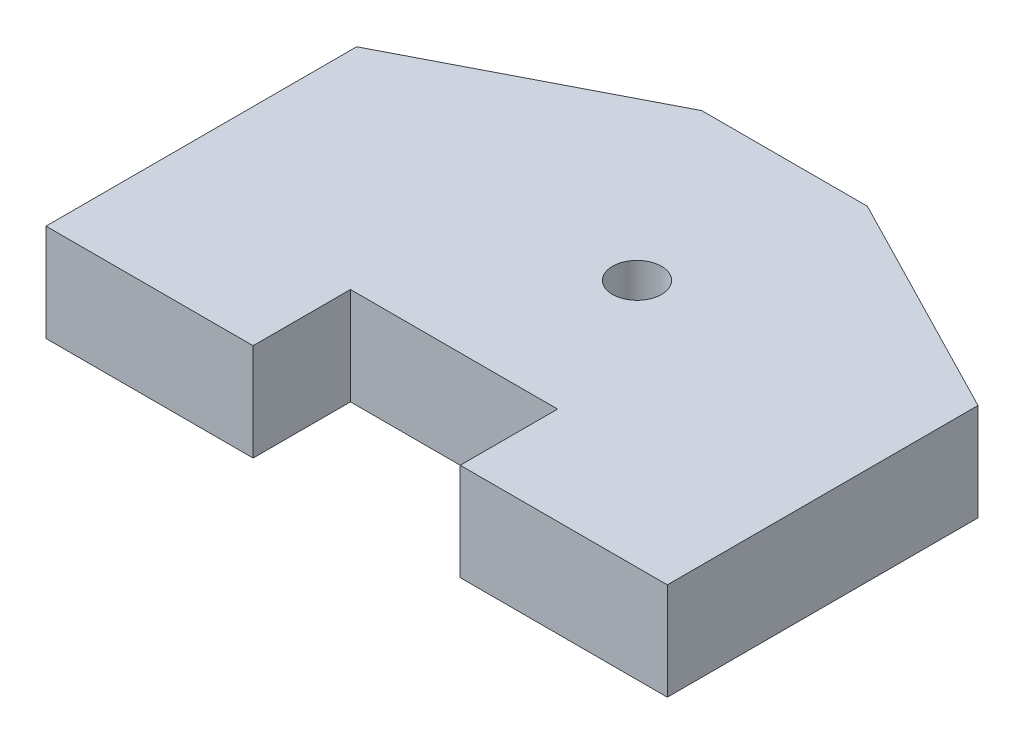
ISO-10303-21;
HEADER;
FILE_DESCRIPTION(('STEP AP214'),'2;1');
FILE_NAME('part.step','',(''),(''),'','','');
FILE_SCHEMA(('AUTOMOTIVE_DESIGN { 1 0 10303 214 1 1 1 1 }'));
ENDSEC;
DATA;
#1=APPLICATION_CONTEXT('core data for automotive mechanical design processes');
#2=APPLICATION_PROTOCOL_DEFINITION('international standard','automotive_design',2000,#1);
#3=PRODUCT_CONTEXT('',#1,'mechanical');
#4=PRODUCT('Part','Part','',(#3));
#5=PRODUCT_RELATED_PRODUCT_CATEGORY('part','',(#4));
#6=PRODUCT_DEFINITION_FORMATION('','',#4);
#7=PRODUCT_DEFINITION_CONTEXT('part definition',#1,'design');
#8=PRODUCT_DEFINITION('design','',#6,#7);
#9=PRODUCT_DEFINITION_SHAPE('','',#8);
#10=(LENGTH_UNIT() NAMED_UNIT(*) SI_UNIT(.MILLI.,.METRE.));
#11=(NAMED_UNIT(*) PLANE_ANGLE_UNIT() SI_UNIT($,.RADIAN.));
#12=(NAMED_UNIT(*) SI_UNIT($,.STERADIAN.) SOLID_ANGLE_UNIT());
#13=UNCERTAINTY_MEASURE_WITH_UNIT(LENGTH_MEASURE(1.E-05),#10,'distance_accuracy_value','');
#14=(GEOMETRIC_REPRESENTATION_CONTEXT(3) GLOBAL_UNCERTAINTY_ASSIGNED_CONTEXT((#13)) GLOBAL_UNIT_ASSIGNED_CONTEXT((#10,
#11,#12)) REPRESENTATION_CONTEXT('',''));
#15=CARTESIAN_POINT('',(0.,0.,0.));
#16=DIRECTION('',(0.,0.,1.));
#17=DIRECTION('',(1.,0.,0.));
#18=AXIS2_PLACEMENT_3D('',#15,#16,#17);
#19=CARTESIAN_POINT('',(0.,5.969,0.));
#20=DIRECTION('',(0.,-1.,0.));
#21=DIRECTION('',(0.,0.,-1.));
#22=AXIS2_PLACEMENT_3D('',#19,#20,#21);
#23=PLANE('',#22);
#24=DIRECTION('',(0.,0.,1.));
#25=VECTOR('',#24,1.);
#26=CARTESIAN_POINT('',(0.,5.969,0.));
#27=LINE('',#26,#25);
#28=CARTESIAN_POINT('',(0.,5.969,-19.05));
#29=VERTEX_POINT('',#28);
#30=CARTESIAN_POINT('',(0.,5.969,0.));
#31=VERTEX_POINT('',#30);
#32=EDGE_CURVE('E160',#29,#31,#27,.T.);
#33=ORIENTED_EDGE('',*,*,#32,.T.);
#34=DIRECTION('',(1.,0.,0.));
#35=VECTOR('',#34,1.);
#36=CARTESIAN_POINT('',(0.,5.969,0.));
#37=LINE('',#36,#35);
#38=CARTESIAN_POINT('',(12.7,5.969,0.));
#39=VERTEX_POINT('',#38);
#40=EDGE_CURVE('E98',#31,#39,#37,.T.);
#41=ORIENTED_EDGE('',*,*,#40,.T.);
#42=DIRECTION('',(0.,0.,-1.));
#43=VECTOR('',#42,1.);
#44=CARTESIAN_POINT('',(12.7,5.969,0.));
#45=LINE('',#44,#43);
#46=CARTESIAN_POINT('',(12.7,5.969,-5.969));
#47=VERTEX_POINT('',#46);
#48=EDGE_CURVE('E181',#39,#47,#45,.T.);
#49=ORIENTED_EDGE('',*,*,#48,.T.);
#50=DIRECTION('',(1.,0.,0.));
#51=VECTOR('',#50,1.);
#52=CARTESIAN_POINT('',(12.7,5.969,-5.969));
#53=LINE('',#52,#51);
#54=CARTESIAN_POINT('',(25.4,5.969,-5.969));
#55=VERTEX_POINT('',#54);
#56=EDGE_CURVE('E200',#47,#55,#53,.T.);
#57=ORIENTED_EDGE('',*,*,#56,.T.);
#58=DIRECTION('',(0.,0.,1.));
#59=VECTOR('',#58,1.);
#60=CARTESIAN_POINT('',(25.4,5.969,-5.969));
#61=LINE('',#60,#59);
#62=CARTESIAN_POINT('',(25.4,5.969,0.));
#63=VERTEX_POINT('',#62);
#64=EDGE_CURVE('E197',#55,#63,#61,.T.);
#65=ORIENTED_EDGE('',*,*,#64,.T.);
#66=DIRECTION('',(1.,0.,0.));
#67=VECTOR('',#66,1.);
#68=CARTESIAN_POINT('',(25.4,5.969,0.));
#69=LINE('',#68,#67);
#70=CARTESIAN_POINT('',(38.1,5.969,0.));
#71=VERTEX_POINT('',#70);
#72=EDGE_CURVE('E199',#63,#71,#69,.T.);
#73=ORIENTED_EDGE('',*,*,#72,.T.);
#74=DIRECTION('',(0.,0.,-1.));
#75=VECTOR('',#74,1.);
#76=CARTESIAN_POINT('',(38.1,5.969,0.));
#77=LINE('',#76,#75);
#78=CARTESIAN_POINT('',(38.1,5.969,-19.05));
#79=VERTEX_POINT('',#78);
#80=EDGE_CURVE('E123',#71,#79,#77,.T.);
#81=ORIENTED_EDGE('',*,*,#80,.T.);
#82=DIRECTION('',(-0.889180512855365,0.,-0.457556570883066));
#83=VECTOR('',#82,1.);
#84=CARTESIAN_POINT('',(38.1,5.969,-19.05));
#85=LINE('',#84,#83);
#86=CARTESIAN_POINT('',(24.13,5.969,-26.2387150053593));
#87=VERTEX_POINT('',#86);
#88=EDGE_CURVE('E117',#79,#87,#85,.T.);
#89=ORIENTED_EDGE('',*,*,#88,.T.);
#90=DIRECTION('',(-1.,0.,0.));
#91=VECTOR('',#90,1.);
#92=CARTESIAN_POINT('',(13.97,5.969,-26.2387150053593));
#93=LINE('',#92,#91);
#94=CARTESIAN_POINT('',(13.97,5.969,-26.2387150053593));
#95=VERTEX_POINT('',#94);
#96=EDGE_CURVE('E121',#87,#95,#93,.T.);
#97=ORIENTED_EDGE('',*,*,#96,.T.);
#98=DIRECTION('',(-0.889180512855365,0.,0.457556570883066));
#99=VECTOR('',#98,1.);
#100=CARTESIAN_POINT('',(0.,5.969,-19.05));
#101=LINE('',#100,#99);
#102=EDGE_CURVE('E49',#95,#29,#101,.T.);
#103=ORIENTED_EDGE('',*,*,#102,.T.);
#104=EDGE_LOOP('',(#33,#41,#49,#57,#65,#73,#81,#89,#97,#103));
#105=FACE_BOUND('',#104,.T.);
#106=CARTESIAN_POINT('',(21.,5.969,-15.24));
#107=DIRECTION('',(0.,1.,0.));
#108=DIRECTION('',(0.,0.,1.));
#109=AXIS2_PLACEMENT_3D('',#106,#107,#108);
#110=CIRCLE('',#109,1.5);
#111=CARTESIAN_POINT('',(21.,5.969,-13.74));
#112=VERTEX_POINT('',#111);
#113=EDGE_CURVE('E145',#112,#112,#110,.T.);
#114=ORIENTED_EDGE('',*,*,#113,.F.);
#115=EDGE_LOOP('',(#114));
#116=FACE_BOUND('',#115,.T.);
#117=ADVANCED_FACE('F32',(#105,#116),#23,.F.);
#118=CARTESIAN_POINT('',(0.,0.,0.));
#119=DIRECTION('',(0.,-1.,0.));
#120=DIRECTION('',(0.,0.,-1.));
#121=AXIS2_PLACEMENT_3D('',#118,#119,#120);
#122=PLANE('',#121);
#123=DIRECTION('',(0.,0.,1.));
#124=VECTOR('',#123,1.);
#125=CARTESIAN_POINT('',(0.,0.,0.));
#126=LINE('',#125,#124);
#127=CARTESIAN_POINT('',(0.,0.,-19.05));
#128=VERTEX_POINT('',#127);
#129=CARTESIAN_POINT('',(0.,0.,0.));
#130=VERTEX_POINT('',#129);
#131=EDGE_CURVE('E141',#128,#130,#126,.T.);
#132=ORIENTED_EDGE('',*,*,#131,.F.);
#133=DIRECTION('',(-0.889180512855365,0.,0.457556570883066));
#134=VECTOR('',#133,1.);
#135=CARTESIAN_POINT('',(0.,0.,-19.05));
#136=LINE('',#135,#134);
#137=CARTESIAN_POINT('',(13.97,0.,-26.2387150053593));
#138=VERTEX_POINT('',#137);
#139=EDGE_CURVE('E90',#138,#128,#136,.T.);
#140=ORIENTED_EDGE('',*,*,#139,.F.);
#141=DIRECTION('',(-1.,0.,0.));
#142=VECTOR('',#141,1.);
#143=CARTESIAN_POINT('',(13.97,0.,-26.2387150053593));
#144=LINE('',#143,#142);
#145=CARTESIAN_POINT('',(24.13,0.,-26.2387150053593));
#146=VERTEX_POINT('',#145);
#147=EDGE_CURVE('E84',#146,#138,#144,.T.);
#148=ORIENTED_EDGE('',*,*,#147,.F.);
#149=DIRECTION('',(-0.889180512855365,0.,-0.457556570883066));
#150=VECTOR('',#149,1.);
#151=CARTESIAN_POINT('',(38.1,0.,-19.05));
#152=LINE('',#151,#150);
#153=CARTESIAN_POINT('',(38.1,0.,-19.05));
#154=VERTEX_POINT('',#153);
#155=EDGE_CURVE('E131',#154,#146,#152,.T.);
#156=ORIENTED_EDGE('',*,*,#155,.F.);
#157=DIRECTION('',(0.,0.,-1.));
#158=VECTOR('',#157,1.);
#159=CARTESIAN_POINT('',(38.1,0.,0.));
#160=LINE('',#159,#158);
#161=CARTESIAN_POINT('',(38.1,0.,0.));
#162=VERTEX_POINT('',#161);
#163=EDGE_CURVE('E155',#162,#154,#160,.T.);
#164=ORIENTED_EDGE('',*,*,#163,.F.);
#165=DIRECTION('',(1.,0.,0.));
#166=VECTOR('',#165,1.);
#167=CARTESIAN_POINT('',(25.4,0.,0.));
#168=LINE('',#167,#166);
#169=CARTESIAN_POINT('',(25.4,0.,0.));
#170=VERTEX_POINT('',#169);
#171=EDGE_CURVE('E153',#170,#162,#168,.T.);
#172=ORIENTED_EDGE('',*,*,#171,.F.);
#173=DIRECTION('',(0.,0.,1.));
#174=VECTOR('',#173,1.);
#175=CARTESIAN_POINT('',(25.4,0.,-5.969));
#176=LINE('',#175,#174);
#177=CARTESIAN_POINT('',(25.4,0.,-5.969));
#178=VERTEX_POINT('',#177);
#179=EDGE_CURVE('E151',#178,#170,#176,.T.);
#180=ORIENTED_EDGE('',*,*,#179,.F.);
#181=DIRECTION('',(1.,0.,0.));
#182=VECTOR('',#181,1.);
#183=CARTESIAN_POINT('',(12.7,0.,-5.969));
#184=LINE('',#183,#182);
#185=CARTESIAN_POINT('',(12.7,0.,-5.969));
#186=VERTEX_POINT('',#185);
#187=EDGE_CURVE('E149',#186,#178,#184,.T.);
#188=ORIENTED_EDGE('',*,*,#187,.F.);
#189=DIRECTION('',(0.,0.,-1.));
#190=VECTOR('',#189,1.);
#191=CARTESIAN_POINT('',(12.7,0.,0.));
#192=LINE('',#191,#190);
#193=CARTESIAN_POINT('',(12.7,0.,0.));
#194=VERTEX_POINT('',#193);
#195=EDGE_CURVE('E147',#194,#186,#192,.T.);
#196=ORIENTED_EDGE('',*,*,#195,.F.);
#197=DIRECTION('',(1.,0.,0.));
#198=VECTOR('',#197,1.);
#199=CARTESIAN_POINT('',(0.,0.,0.));
#200=LINE('',#199,#198);
#201=EDGE_CURVE('E144',#130,#194,#200,.T.);
#202=ORIENTED_EDGE('',*,*,#201,.F.);
#203=EDGE_LOOP('',(#132,#140,#148,#156,#164,#172,#180,#188,#196,#202));
#204=FACE_BOUND('',#203,.T.);
#205=CARTESIAN_POINT('',(21.,0.,-15.24));
#206=DIRECTION('',(0.,1.,0.));
#207=DIRECTION('',(0.,0.,1.));
#208=AXIS2_PLACEMENT_3D('',#205,#206,#207);
#209=CIRCLE('',#208,1.5);
#210=CARTESIAN_POINT('',(21.,0.,-13.74));
#211=VERTEX_POINT('',#210);
#212=EDGE_CURVE('E208',#211,#211,#209,.T.);
#213=ORIENTED_EDGE('',*,*,#212,.T.);
#214=EDGE_LOOP('',(#213));
#215=FACE_BOUND('',#214,.T.);
#216=ADVANCED_FACE('F185',(#204,#215),#122,.T.);
#217=CARTESIAN_POINT('',(0.,5.969,0.));
#218=DIRECTION('',(1.,0.,0.));
#219=DIRECTION('',(0.,0.,-1.));
#220=AXIS2_PLACEMENT_3D('',#217,#218,#219);
#221=PLANE('',#220);
#222=ORIENTED_EDGE('',*,*,#131,.T.);
#223=DIRECTION('',(0.,-1.,0.));
#224=VECTOR('',#223,1.);
#225=CARTESIAN_POINT('',(0.,5.969,0.));
#226=LINE('',#225,#224);
#227=EDGE_CURVE('E11',#31,#130,#226,.T.);
#228=ORIENTED_EDGE('',*,*,#227,.F.);
#229=ORIENTED_EDGE('',*,*,#32,.F.);
#230=DIRECTION('',(0.,-1.,0.));
#231=VECTOR('',#230,1.);
#232=CARTESIAN_POINT('',(0.,5.969,-19.05));
#233=LINE('',#232,#231);
#234=EDGE_CURVE('E137',#29,#128,#233,.T.);
#235=ORIENTED_EDGE('',*,*,#234,.T.);
#236=EDGE_LOOP('',(#222,#228,#229,#235));
#237=FACE_BOUND('',#236,.T.);
#238=ADVANCED_FACE('F34',(#237),#221,.F.);
#239=CARTESIAN_POINT('',(0.,5.969,0.));
#240=DIRECTION('',(0.,0.,-1.));
#241=DIRECTION('',(-1.,0.,0.));
#242=AXIS2_PLACEMENT_3D('',#239,#240,#241);
#243=PLANE('',#242);
#244=ORIENTED_EDGE('',*,*,#201,.T.);
#245=DIRECTION('',(0.,-1.,0.));
#246=VECTOR('',#245,1.);
#247=CARTESIAN_POINT('',(12.7,5.969,0.));
#248=LINE('',#247,#246);
#249=EDGE_CURVE('E41',#39,#194,#248,.T.);
#250=ORIENTED_EDGE('',*,*,#249,.F.);
#251=ORIENTED_EDGE('',*,*,#40,.F.);
#252=ORIENTED_EDGE('',*,*,#227,.T.);
#253=EDGE_LOOP('',(#244,#250,#251,#252));
#254=FACE_BOUND('',#253,.T.);
#255=ADVANCED_FACE('F244',(#254),#243,.F.);
#256=CARTESIAN_POINT('',(12.7,5.969,0.));
#257=DIRECTION('',(-1.,0.,0.));
#258=DIRECTION('',(0.,0.,1.));
#259=AXIS2_PLACEMENT_3D('',#256,#257,#258);
#260=PLANE('',#259);
#261=ORIENTED_EDGE('',*,*,#195,.T.);
#262=DIRECTION('',(0.,-1.,0.));
#263=VECTOR('',#262,1.);
#264=CARTESIAN_POINT('',(12.7,5.969,-5.969));
#265=LINE('',#264,#263);
#266=EDGE_CURVE('E173',#47,#186,#265,.T.);
#267=ORIENTED_EDGE('',*,*,#266,.F.);
#268=ORIENTED_EDGE('',*,*,#48,.F.);
#269=ORIENTED_EDGE('',*,*,#249,.T.);
#270=EDGE_LOOP('',(#261,#267,#268,#269));
#271=FACE_BOUND('',#270,.T.);
#272=ADVANCED_FACE('F179',(#271),#260,.F.);
#273=CARTESIAN_POINT('',(12.7,5.969,-5.969));
#274=DIRECTION('',(0.,0.,-1.));
#275=DIRECTION('',(-1.,0.,0.));
#276=AXIS2_PLACEMENT_3D('',#273,#274,#275);
#277=PLANE('',#276);
#278=ORIENTED_EDGE('',*,*,#187,.T.);
#279=DIRECTION('',(0.,-1.,0.));
#280=VECTOR('',#279,1.);
#281=CARTESIAN_POINT('',(25.4,5.969,-5.969));
#282=LINE('',#281,#280);
#283=EDGE_CURVE('E170',#55,#178,#282,.T.);
#284=ORIENTED_EDGE('',*,*,#283,.F.);
#285=ORIENTED_EDGE('',*,*,#56,.F.);
#286=ORIENTED_EDGE('',*,*,#266,.T.);
#287=EDGE_LOOP('',(#278,#284,#285,#286));
#288=FACE_BOUND('',#287,.T.);
#289=ADVANCED_FACE('F191',(#288),#277,.F.);
#290=CARTESIAN_POINT('',(25.4,5.969,-5.969));
#291=DIRECTION('',(1.,0.,0.));
#292=DIRECTION('',(0.,0.,-1.));
#293=AXIS2_PLACEMENT_3D('',#290,#291,#292);
#294=PLANE('',#293);
#295=ORIENTED_EDGE('',*,*,#179,.T.);
#296=DIRECTION('',(0.,-1.,0.));
#297=VECTOR('',#296,1.);
#298=CARTESIAN_POINT('',(25.4,5.969,0.));
#299=LINE('',#298,#297);
#300=EDGE_CURVE('E167',#63,#170,#299,.T.);
#301=ORIENTED_EDGE('',*,*,#300,.F.);
#302=ORIENTED_EDGE('',*,*,#64,.F.);
#303=ORIENTED_EDGE('',*,*,#283,.T.);
#304=EDGE_LOOP('',(#295,#301,#302,#303));
#305=FACE_BOUND('',#304,.T.);
#306=ADVANCED_FACE('F195',(#305),#294,.F.);
#307=CARTESIAN_POINT('',(25.4,5.969,0.));
#308=DIRECTION('',(0.,0.,-1.));
#309=DIRECTION('',(-1.,0.,0.));
#310=AXIS2_PLACEMENT_3D('',#307,#308,#309);
#311=PLANE('',#310);
#312=ORIENTED_EDGE('',*,*,#171,.T.);
#313=DIRECTION('',(0.,-1.,0.));
#314=VECTOR('',#313,1.);
#315=CARTESIAN_POINT('',(38.1,5.969,0.));
#316=LINE('',#315,#314);
#317=EDGE_CURVE('E164',#71,#162,#316,.T.);
#318=ORIENTED_EDGE('',*,*,#317,.F.);
#319=ORIENTED_EDGE('',*,*,#72,.F.);
#320=ORIENTED_EDGE('',*,*,#300,.T.);
#321=EDGE_LOOP('',(#312,#318,#319,#320));
#322=FACE_BOUND('',#321,.T.);
#323=ADVANCED_FACE('F234',(#322),#311,.F.);
#324=CARTESIAN_POINT('',(38.1,5.969,0.));
#325=DIRECTION('',(-1.,0.,0.));
#326=DIRECTION('',(0.,0.,1.));
#327=AXIS2_PLACEMENT_3D('',#324,#325,#326);
#328=PLANE('',#327);
#329=ORIENTED_EDGE('',*,*,#163,.T.);
#330=DIRECTION('',(0.,-1.,0.));
#331=VECTOR('',#330,1.);
#332=CARTESIAN_POINT('',(38.1,5.969,-19.05));
#333=LINE('',#332,#331);
#334=EDGE_CURVE('E132',#79,#154,#333,.T.);
#335=ORIENTED_EDGE('',*,*,#334,.F.);
#336=ORIENTED_EDGE('',*,*,#80,.F.);
#337=ORIENTED_EDGE('',*,*,#317,.T.);
#338=EDGE_LOOP('',(#329,#335,#336,#337));
#339=FACE_BOUND('',#338,.T.);
#340=ADVANCED_FACE('F231',(#339),#328,.F.);
#341=CARTESIAN_POINT('',(38.1,5.969,-19.05));
#342=DIRECTION('',(-0.457556570883066,0.,0.889180512855365));
#343=DIRECTION('',(0.889180512855365,0.,0.457556570883066));
#344=AXIS2_PLACEMENT_3D('',#341,#342,#343);
#345=PLANE('',#344);
#346=ORIENTED_EDGE('',*,*,#155,.T.);
#347=DIRECTION('',(0.,-1.,0.));
#348=VECTOR('',#347,1.);
#349=CARTESIAN_POINT('',(24.13,5.969,-26.2387150053593));
#350=LINE('',#349,#348);
#351=EDGE_CURVE('E128',#87,#146,#350,.T.);
#352=ORIENTED_EDGE('',*,*,#351,.F.);
#353=ORIENTED_EDGE('',*,*,#88,.F.);
#354=ORIENTED_EDGE('',*,*,#334,.T.);
#355=EDGE_LOOP('',(#346,#352,#353,#354));
#356=FACE_BOUND('',#355,.T.);
#357=ADVANCED_FACE('F129',(#356),#345,.F.);
#358=CARTESIAN_POINT('',(13.97,5.969,-26.2387150053593));
#359=DIRECTION('',(0.,0.,1.));
#360=DIRECTION('',(1.,0.,0.));
#361=AXIS2_PLACEMENT_3D('',#358,#359,#360);
#362=PLANE('',#361);
#363=ORIENTED_EDGE('',*,*,#147,.T.);
#364=DIRECTION('',(0.,-1.,0.));
#365=VECTOR('',#364,1.);
#366=CARTESIAN_POINT('',(13.97,5.969,-26.2387150053593));
#367=LINE('',#366,#365);
#368=EDGE_CURVE('E133',#95,#138,#367,.T.);
#369=ORIENTED_EDGE('',*,*,#368,.F.);
#370=ORIENTED_EDGE('',*,*,#96,.F.);
#371=ORIENTED_EDGE('',*,*,#351,.T.);
#372=EDGE_LOOP('',(#363,#369,#370,#371));
#373=FACE_BOUND('',#372,.T.);
#374=ADVANCED_FACE('F135',(#373),#362,.F.);
#375=CARTESIAN_POINT('',(0.,5.969,-19.05));
#376=DIRECTION('',(0.457556570883066,0.,0.889180512855365));
#377=DIRECTION('',(0.889180512855365,0.,-0.457556570883066));
#378=AXIS2_PLACEMENT_3D('',#375,#376,#377);
#379=PLANE('',#378);
#380=ORIENTED_EDGE('',*,*,#139,.T.);
#381=ORIENTED_EDGE('',*,*,#234,.F.);
#382=ORIENTED_EDGE('',*,*,#102,.F.);
#383=ORIENTED_EDGE('',*,*,#368,.T.);
#384=EDGE_LOOP('',(#380,#381,#382,#383));
#385=FACE_BOUND('',#384,.T.);
#386=ADVANCED_FACE('F224',(#385),#379,.F.);
#387=CARTESIAN_POINT('',(21.,5.969,-15.24));
#388=DIRECTION('',(0.,-1.,0.));
#389=DIRECTION('',(0.,0.,-1.));
#390=AXIS2_PLACEMENT_3D('',#387,#388,#389);
#391=CYLINDRICAL_SURFACE('',#390,1.5);
#392=ORIENTED_EDGE('',*,*,#113,.T.);
#393=EDGE_LOOP('',(#392));
#394=FACE_BOUND('',#393,.T.);
#395=ORIENTED_EDGE('',*,*,#212,.F.);
#396=EDGE_LOOP('',(#395));
#397=FACE_BOUND('',#396,.T.);
#398=ADVANCED_FACE('F214',(#394,#397),#391,.F.);
#399=CLOSED_SHELL('',(#117,#216,#238,#255,#272,#289,#306,#323,#340,#357,#374,#386,#398));
#400=MANIFOLD_SOLID_BREP('B2',#399);
#401=ADVANCED_BREP_SHAPE_REPRESENTATION('',(#18,#400),#14);
#402=SHAPE_DEFINITION_REPRESENTATION(#9,#401);
ENDSEC;
END-ISO-10303-21;
